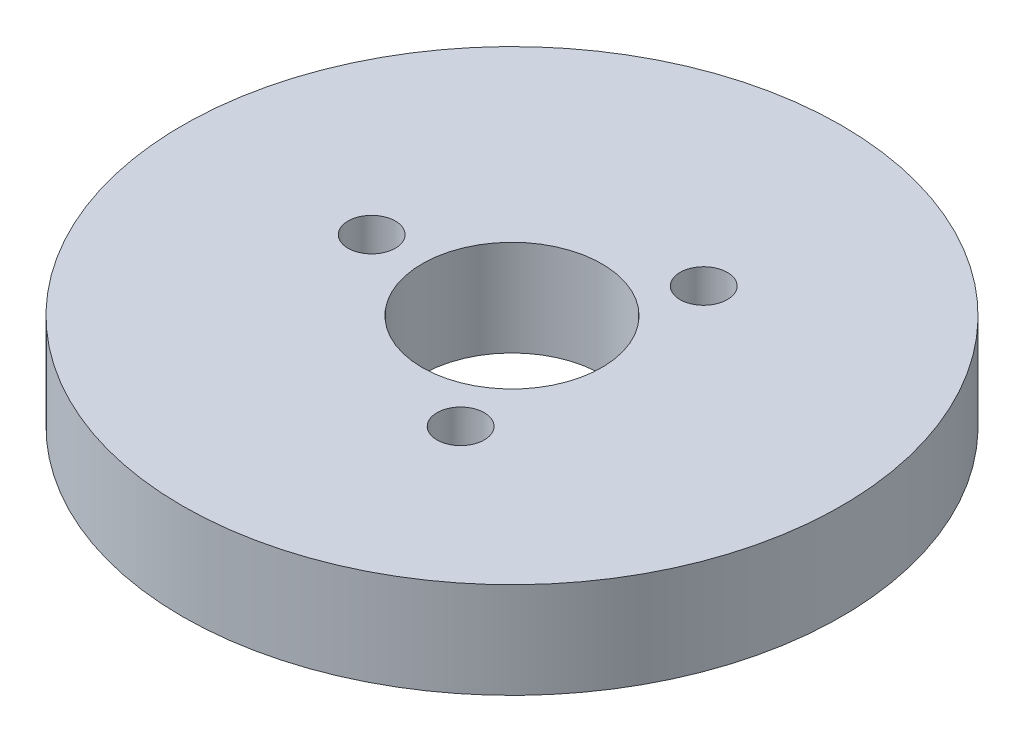
ISO-10303-21;
HEADER;
FILE_DESCRIPTION(('STEP AP214'),'2;1');
FILE_NAME('part.step','',(''),(''),'','','');
FILE_SCHEMA(('AUTOMOTIVE_DESIGN { 1 0 10303 214 1 1 1 1 }'));
ENDSEC;
DATA;
#1=APPLICATION_CONTEXT('core data for automotive mechanical design processes');
#2=APPLICATION_PROTOCOL_DEFINITION('international standard','automotive_design',2000,#1);
#3=PRODUCT_CONTEXT('',#1,'mechanical');
#4=PRODUCT('Part','Part','',(#3));
#5=PRODUCT_RELATED_PRODUCT_CATEGORY('part','',(#4));
#6=PRODUCT_DEFINITION_FORMATION('','',#4);
#7=PRODUCT_DEFINITION_CONTEXT('part definition',#1,'design');
#8=PRODUCT_DEFINITION('design','',#6,#7);
#9=PRODUCT_DEFINITION_SHAPE('','',#8);
#10=(LENGTH_UNIT() NAMED_UNIT(*) SI_UNIT(.MILLI.,.METRE.));
#11=(NAMED_UNIT(*) PLANE_ANGLE_UNIT() SI_UNIT($,.RADIAN.));
#12=(NAMED_UNIT(*) SI_UNIT($,.STERADIAN.) SOLID_ANGLE_UNIT());
#13=UNCERTAINTY_MEASURE_WITH_UNIT(LENGTH_MEASURE(1.E-05),#10,'distance_accuracy_value','');
#14=(GEOMETRIC_REPRESENTATION_CONTEXT(3) GLOBAL_UNCERTAINTY_ASSIGNED_CONTEXT((#13)) GLOBAL_UNIT_ASSIGNED_CONTEXT((#10,
#11,#12)) REPRESENTATION_CONTEXT('',''));
#15=CARTESIAN_POINT('',(0.,0.,0.));
#16=DIRECTION('',(0.,0.,1.));
#17=DIRECTION('',(1.,0.,0.));
#18=AXIS2_PLACEMENT_3D('',#15,#16,#17);
#19=CARTESIAN_POINT('',(0.,8.,0.));
#20=DIRECTION('',(0.,-1.,0.));
#21=DIRECTION('',(0.,0.,-1.));
#22=AXIS2_PLACEMENT_3D('',#19,#20,#21);
#23=CYLINDRICAL_SURFACE('',#22,27.5);
#24=CARTESIAN_POINT('',(0.,8.,0.));
#25=DIRECTION('',(0.,1.,0.));
#26=DIRECTION('',(0.,0.,1.));
#27=AXIS2_PLACEMENT_3D('',#24,#25,#26);
#28=CIRCLE('',#27,27.5);
#29=CARTESIAN_POINT('',(0.,8.,27.5));
#30=VERTEX_POINT('',#29);
#31=EDGE_CURVE('E10',#30,#30,#28,.T.);
#32=ORIENTED_EDGE('',*,*,#31,.F.);
#33=EDGE_LOOP('',(#32));
#34=FACE_BOUND('',#33,.T.);
#35=CARTESIAN_POINT('',(0.,0.,0.));
#36=DIRECTION('',(0.,1.,0.));
#37=DIRECTION('',(0.,0.,1.));
#38=AXIS2_PLACEMENT_3D('',#35,#36,#37);
#39=CIRCLE('',#38,27.5);
#40=CARTESIAN_POINT('',(0.,0.,27.5));
#41=VERTEX_POINT('',#40);
#42=EDGE_CURVE('E37',#41,#41,#39,.T.);
#43=ORIENTED_EDGE('',*,*,#42,.T.);
#44=EDGE_LOOP('',(#43));
#45=FACE_BOUND('',#44,.T.);
#46=ADVANCED_FACE('F40',(#34,#45),#23,.T.);
#47=CARTESIAN_POINT('',(0.,8.,0.));
#48=DIRECTION('',(0.,1.,0.));
#49=DIRECTION('',(0.,0.,1.));
#50=AXIS2_PLACEMENT_3D('',#47,#48,#49);
#51=PLANE('',#50);
#52=CARTESIAN_POINT('',(5.85492461950254,8.,10.1410269154642));
#53=DIRECTION('',(0.,1.,0.));
#54=DIRECTION('',(0.866025403784436,0.,-0.500000000000004));
#55=AXIS2_PLACEMENT_3D('',#52,#53,#54);
#56=CIRCLE('',#55,1.97331674922149);
#57=CARTESIAN_POINT('',(7.56386705404167,8.,9.15436854085341));
#58=VERTEX_POINT('',#57);
#59=EDGE_CURVE('E70',#58,#58,#56,.T.);
#60=ORIENTED_EDGE('',*,*,#59,.F.);
#61=EDGE_LOOP('',(#60));
#62=FACE_BOUND('',#61,.T.);
#63=CARTESIAN_POINT('',(5.85492461950239,8.,-10.1410269154642));
#64=DIRECTION('',(0.,1.,0.));
#65=DIRECTION('',(-0.866025403784443,0.,-0.499999999999992));
#66=AXIS2_PLACEMENT_3D('',#63,#64,#65);
#67=CIRCLE('',#66,1.97331674922149);
#68=CARTESIAN_POINT('',(4.14598218496324,8.,-11.127685290075));
#69=VERTEX_POINT('',#68);
#70=EDGE_CURVE('E61',#69,#69,#67,.T.);
#71=ORIENTED_EDGE('',*,*,#70,.F.);
#72=EDGE_LOOP('',(#71));
#73=FACE_BOUND('',#72,.T.);
#74=CARTESIAN_POINT('',(-11.709849239005,8.,0.));
#75=DIRECTION('',(0.,1.,0.));
#76=DIRECTION('',(0.,0.,1.));
#77=AXIS2_PLACEMENT_3D('',#74,#75,#76);
#78=CIRCLE('',#77,1.97331674922149);
#79=CARTESIAN_POINT('',(-11.709849239005,8.,1.97331674922149));
#80=VERTEX_POINT('',#79);
#81=EDGE_CURVE('E54',#80,#80,#78,.T.);
#82=ORIENTED_EDGE('',*,*,#81,.F.);
#83=EDGE_LOOP('',(#82));
#84=FACE_BOUND('',#83,.T.);
#85=CARTESIAN_POINT('',(0.,8.,0.));
#86=DIRECTION('',(0.,1.,0.));
#87=DIRECTION('',(0.,0.,1.));
#88=AXIS2_PLACEMENT_3D('',#85,#86,#87);
#89=CIRCLE('',#88,7.5);
#90=CARTESIAN_POINT('',(0.,8.,7.5));
#91=VERTEX_POINT('',#90);
#92=EDGE_CURVE('E50',#91,#91,#89,.T.);
#93=ORIENTED_EDGE('',*,*,#92,.F.);
#94=EDGE_LOOP('',(#93));
#95=FACE_BOUND('',#94,.T.);
#96=ORIENTED_EDGE('',*,*,#31,.T.);
#97=EDGE_LOOP('',(#96));
#98=FACE_BOUND('',#97,.T.);
#99=ADVANCED_FACE('F85',(#62,#73,#84,#95,#98),#51,.T.);
#100=CARTESIAN_POINT('',(0.,0.,0.));
#101=DIRECTION('',(0.,1.,0.));
#102=DIRECTION('',(0.,0.,1.));
#103=AXIS2_PLACEMENT_3D('',#100,#101,#102);
#104=PLANE('',#103);
#105=CARTESIAN_POINT('',(0.,0.,0.));
#106=DIRECTION('',(0.,1.,0.));
#107=DIRECTION('',(0.,0.,1.));
#108=AXIS2_PLACEMENT_3D('',#105,#106,#107);
#109=CIRCLE('',#108,7.5);
#110=CARTESIAN_POINT('',(0.,0.,7.5));
#111=VERTEX_POINT('',#110);
#112=EDGE_CURVE('E47',#111,#111,#109,.T.);
#113=ORIENTED_EDGE('',*,*,#112,.T.);
#114=EDGE_LOOP('',(#113));
#115=FACE_BOUND('',#114,.T.);
#116=ORIENTED_EDGE('',*,*,#42,.F.);
#117=EDGE_LOOP('',(#116));
#118=FACE_BOUND('',#117,.T.);
#119=ADVANCED_FACE('F84',(#115,#118),#104,.F.);
#120=CARTESIAN_POINT('',(0.,8.,0.));
#121=DIRECTION('',(0.,-1.,0.));
#122=DIRECTION('',(0.,0.,-1.));
#123=AXIS2_PLACEMENT_3D('',#120,#121,#122);
#124=CYLINDRICAL_SURFACE('',#123,7.5);
#125=ORIENTED_EDGE('',*,*,#92,.T.);
#126=EDGE_LOOP('',(#125));
#127=FACE_BOUND('',#126,.T.);
#128=ORIENTED_EDGE('',*,*,#112,.F.);
#129=EDGE_LOOP('',(#128));
#130=FACE_BOUND('',#129,.T.);
#131=ADVANCED_FACE('F91',(#127,#130),#124,.F.);
#132=CARTESIAN_POINT('',(-11.709849239005,1.35705398293371,0.));
#133=DIRECTION('',(0.,1.,0.));
#134=DIRECTION('',(0.,0.,1.));
#135=AXIS2_PLACEMENT_3D('',#132,#133,#134);
#136=CYLINDRICAL_SURFACE('',#135,1.97331674922149);
#137=CARTESIAN_POINT('',(-11.709849239005,1.35705398293371,0.));
#138=DIRECTION('',(0.,1.,0.));
#139=DIRECTION('',(0.,0.,1.));
#140=AXIS2_PLACEMENT_3D('',#137,#138,#139);
#141=CIRCLE('',#140,1.97331674922149);
#142=CARTESIAN_POINT('',(-11.709849239005,1.35705398293371,1.97331674922149));
#143=VERTEX_POINT('',#142);
#144=EDGE_CURVE('E55',#143,#143,#141,.T.);
#145=ORIENTED_EDGE('',*,*,#144,.F.);
#146=EDGE_LOOP('',(#145));
#147=FACE_BOUND('',#146,.T.);
#148=ORIENTED_EDGE('',*,*,#81,.T.);
#149=EDGE_LOOP('',(#148));
#150=FACE_BOUND('',#149,.T.);
#151=ADVANCED_FACE('F96',(#147,#150),#136,.F.);
#152=CARTESIAN_POINT('',(-11.709849239005,1.35705398293371,0.));
#153=DIRECTION('',(0.,1.,0.));
#154=DIRECTION('',(0.,0.,1.));
#155=AXIS2_PLACEMENT_3D('',#152,#153,#154);
#156=PLANE('',#155);
#157=ORIENTED_EDGE('',*,*,#144,.T.);
#158=EDGE_LOOP('',(#157));
#159=FACE_BOUND('',#158,.T.);
#160=ADVANCED_FACE('F127',(#159),#156,.T.);
#161=CARTESIAN_POINT('',(5.85492461950239,1.35705398293371,-10.1410269154642));
#162=DIRECTION('',(0.,1.,0.));
#163=DIRECTION('',(0.,0.,1.));
#164=AXIS2_PLACEMENT_3D('',#161,#162,#163);
#165=CYLINDRICAL_SURFACE('',#164,1.97331674922149);
#166=CARTESIAN_POINT('',(5.85492461950239,1.35705398293371,-10.1410269154642));
#167=DIRECTION('',(0.,1.,0.));
#168=DIRECTION('',(-0.866025403784443,0.,-0.499999999999992));
#169=AXIS2_PLACEMENT_3D('',#166,#167,#168);
#170=CIRCLE('',#169,1.97331674922149);
#171=CARTESIAN_POINT('',(4.14598218496324,1.35705398293371,-11.127685290075));
#172=VERTEX_POINT('',#171);
#173=EDGE_CURVE('E63',#172,#172,#170,.T.);
#174=ORIENTED_EDGE('',*,*,#173,.F.);
#175=EDGE_LOOP('',(#174));
#176=FACE_BOUND('',#175,.T.);
#177=ORIENTED_EDGE('',*,*,#70,.T.);
#178=EDGE_LOOP('',(#177));
#179=FACE_BOUND('',#178,.T.);
#180=ADVANCED_FACE('F133',(#176,#179),#165,.F.);
#181=CARTESIAN_POINT('',(5.85492461950239,1.35705398293371,-10.1410269154642));
#182=DIRECTION('',(0.,1.,0.));
#183=DIRECTION('',(-0.866025403784443,0.,-0.499999999999992));
#184=AXIS2_PLACEMENT_3D('',#181,#182,#183);
#185=PLANE('',#184);
#186=ORIENTED_EDGE('',*,*,#173,.T.);
#187=EDGE_LOOP('',(#186));
#188=FACE_BOUND('',#187,.T.);
#189=ADVANCED_FACE('F77',(#188),#185,.T.);
#190=CARTESIAN_POINT('',(5.85492461950254,1.35705398293371,10.1410269154642));
#191=DIRECTION('',(0.,1.,0.));
#192=DIRECTION('',(0.,0.,1.));
#193=AXIS2_PLACEMENT_3D('',#190,#191,#192);
#194=CYLINDRICAL_SURFACE('',#193,1.97331674922149);
#195=CARTESIAN_POINT('',(5.85492461950254,1.35705398293371,10.1410269154642));
#196=DIRECTION('',(0.,1.,0.));
#197=DIRECTION('',(0.866025403784436,0.,-0.500000000000004));
#198=AXIS2_PLACEMENT_3D('',#195,#196,#197);
#199=CIRCLE('',#198,1.97331674922149);
#200=CARTESIAN_POINT('',(7.56386705404167,1.35705398293371,9.15436854085341));
#201=VERTEX_POINT('',#200);
#202=EDGE_CURVE('E59',#201,#201,#199,.T.);
#203=ORIENTED_EDGE('',*,*,#202,.F.);
#204=EDGE_LOOP('',(#203));
#205=FACE_BOUND('',#204,.T.);
#206=ORIENTED_EDGE('',*,*,#59,.T.);
#207=EDGE_LOOP('',(#206));
#208=FACE_BOUND('',#207,.T.);
#209=ADVANCED_FACE('F73',(#205,#208),#194,.F.);
#210=CARTESIAN_POINT('',(5.85492461950254,1.35705398293371,10.1410269154642));
#211=DIRECTION('',(0.,1.,0.));
#212=DIRECTION('',(0.866025403784436,0.,-0.500000000000004));
#213=AXIS2_PLACEMENT_3D('',#210,#211,#212);
#214=PLANE('',#213);
#215=ORIENTED_EDGE('',*,*,#202,.T.);
#216=EDGE_LOOP('',(#215));
#217=FACE_BOUND('',#216,.T.);
#218=ADVANCED_FACE('F71',(#217),#214,.T.);
#219=CLOSED_SHELL('',(#46,#99,#119,#131,#151,#160,#180,#189,#209,#218));
#220=MANIFOLD_SOLID_BREP('B2',#219);
#221=ADVANCED_BREP_SHAPE_REPRESENTATION('',(#18,#220),#14);
#222=SHAPE_DEFINITION_REPRESENTATION(#9,#221);
ENDSEC;
END-ISO-10303-21;
